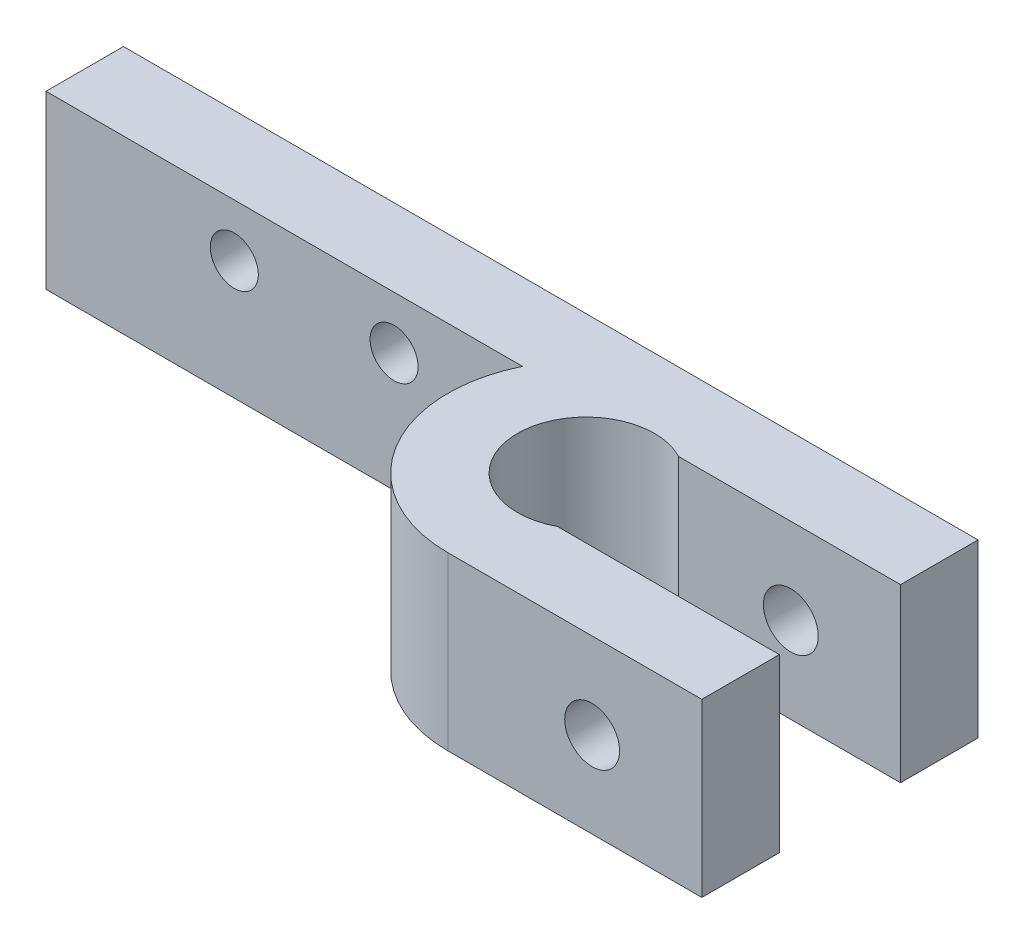
ISO-10303-21;
HEADER;
FILE_DESCRIPTION(('STEP AP214'),'2;1');
FILE_NAME('part.step','',(''),(''),'','','');
FILE_SCHEMA(('AUTOMOTIVE_DESIGN { 1 0 10303 214 1 1 1 1 }'));
ENDSEC;
DATA;
#1=APPLICATION_CONTEXT('core data for automotive mechanical design processes');
#2=APPLICATION_PROTOCOL_DEFINITION('international standard','automotive_design',2000,#1);
#3=PRODUCT_CONTEXT('',#1,'mechanical');
#4=PRODUCT('Part','Part','',(#3));
#5=PRODUCT_RELATED_PRODUCT_CATEGORY('part','',(#4));
#6=PRODUCT_DEFINITION_FORMATION('','',#4);
#7=PRODUCT_DEFINITION_CONTEXT('part definition',#1,'design');
#8=PRODUCT_DEFINITION('design','',#6,#7);
#9=PRODUCT_DEFINITION_SHAPE('','',#8);
#10=(LENGTH_UNIT() NAMED_UNIT(*) SI_UNIT(.MILLI.,.METRE.));
#11=(NAMED_UNIT(*) PLANE_ANGLE_UNIT() SI_UNIT($,.RADIAN.));
#12=(NAMED_UNIT(*) SI_UNIT($,.STERADIAN.) SOLID_ANGLE_UNIT());
#13=UNCERTAINTY_MEASURE_WITH_UNIT(LENGTH_MEASURE(1.E-05),#10,'distance_accuracy_value','');
#14=(GEOMETRIC_REPRESENTATION_CONTEXT(3) GLOBAL_UNCERTAINTY_ASSIGNED_CONTEXT((#13)) GLOBAL_UNIT_ASSIGNED_CONTEXT((#10,
#11,#12)) REPRESENTATION_CONTEXT('',''));
#15=CARTESIAN_POINT('',(0.,0.,0.));
#16=DIRECTION('',(0.,0.,1.));
#17=DIRECTION('',(1.,0.,0.));
#18=AXIS2_PLACEMENT_3D('',#15,#16,#17);
#19=CARTESIAN_POINT('',(-14.815,10.01,8.055));
#20=DIRECTION('',(0.,-1.,0.));
#21=DIRECTION('',(0.,0.,-1.));
#22=AXIS2_PLACEMENT_3D('',#19,#20,#21);
#23=CYLINDRICAL_SURFACE('',#22,8.055);
#24=CARTESIAN_POINT('',(-14.815,0.,8.055));
#25=DIRECTION('',(0.,1.,0.));
#26=DIRECTION('',(0.,0.,1.));
#27=AXIS2_PLACEMENT_3D('',#24,#25,#26);
#28=CIRCLE('',#27,8.055);
#29=CARTESIAN_POINT('',(-22.052872615624,0.,4.52));
#30=VERTEX_POINT('',#29);
#31=CARTESIAN_POINT('',(-14.815,0.,16.11));
#32=VERTEX_POINT('',#31);
#33=EDGE_CURVE('E139',#30,#32,#28,.T.);
#34=ORIENTED_EDGE('',*,*,#33,.T.);
#35=DIRECTION('',(0.,-1.,0.));
#36=VECTOR('',#35,1.);
#37=CARTESIAN_POINT('',(-14.815,10.01,16.11));
#38=LINE('',#37,#36);
#39=CARTESIAN_POINT('',(-14.815,10.01,16.11));
#40=VERTEX_POINT('',#39);
#41=EDGE_CURVE('E38',#40,#32,#38,.T.);
#42=ORIENTED_EDGE('',*,*,#41,.F.);
#43=CARTESIAN_POINT('',(-14.815,10.01,8.055));
#44=DIRECTION('',(0.,1.,0.));
#45=DIRECTION('',(0.,0.,1.));
#46=AXIS2_PLACEMENT_3D('',#43,#44,#45);
#47=CIRCLE('',#46,8.055);
#48=CARTESIAN_POINT('',(-22.052872615624,10.01,4.52));
#49=VERTEX_POINT('',#48);
#50=EDGE_CURVE('E157',#49,#40,#47,.T.);
#51=ORIENTED_EDGE('',*,*,#50,.F.);
#52=DIRECTION('',(0.,-1.,0.));
#53=VECTOR('',#52,1.);
#54=CARTESIAN_POINT('',(-22.052872615624,10.01,4.52));
#55=LINE('',#54,#53);
#56=EDGE_CURVE('E135',#49,#30,#55,.T.);
#57=ORIENTED_EDGE('',*,*,#56,.T.);
#58=EDGE_LOOP('',(#34,#42,#51,#57));
#59=FACE_BOUND('',#58,.T.);
#60=ADVANCED_FACE('F31',(#59),#23,.T.);
#61=CARTESIAN_POINT('',(-14.815,10.01,16.11));
#62=DIRECTION('',(0.,0.,-1.));
#63=DIRECTION('',(-1.,0.,0.));
#64=AXIS2_PLACEMENT_3D('',#61,#62,#63);
#65=PLANE('',#64);
#66=CARTESIAN_POINT('',(-6.39994887972684,5.005,16.11));
#67=DIRECTION('',(0.,0.,-1.));
#68=DIRECTION('',(-1.,0.,0.));
#69=AXIS2_PLACEMENT_3D('',#66,#67,#68);
#70=CIRCLE('',#69,1.6);
#71=CARTESIAN_POINT('',(-7.99994887972684,5.005,16.11));
#72=VERTEX_POINT('',#71);
#73=EDGE_CURVE('E209',#72,#72,#70,.T.);
#74=ORIENTED_EDGE('',*,*,#73,.T.);
#75=EDGE_LOOP('',(#74));
#76=FACE_BOUND('',#75,.T.);
#77=DIRECTION('',(1.,0.,0.));
#78=VECTOR('',#77,1.);
#79=CARTESIAN_POINT('',(-14.815,0.,16.11));
#80=LINE('',#79,#78);
#81=CARTESIAN_POINT('',(0.,0.,16.11));
#82=VERTEX_POINT('',#81);
#83=EDGE_CURVE('E142',#32,#82,#80,.T.);
#84=ORIENTED_EDGE('',*,*,#83,.T.);
#85=DIRECTION('',(0.,-1.,0.));
#86=VECTOR('',#85,1.);
#87=CARTESIAN_POINT('',(0.,10.01,16.11));
#88=LINE('',#87,#86);
#89=CARTESIAN_POINT('',(0.,10.01,16.11));
#90=VERTEX_POINT('',#89);
#91=EDGE_CURVE('E167',#90,#82,#88,.T.);
#92=ORIENTED_EDGE('',*,*,#91,.F.);
#93=DIRECTION('',(1.,0.,0.));
#94=VECTOR('',#93,1.);
#95=CARTESIAN_POINT('',(-14.815,10.01,16.11));
#96=LINE('',#95,#94);
#97=EDGE_CURVE('E95',#40,#90,#96,.T.);
#98=ORIENTED_EDGE('',*,*,#97,.F.);
#99=ORIENTED_EDGE('',*,*,#41,.T.);
#100=EDGE_LOOP('',(#84,#92,#98,#99));
#101=FACE_BOUND('',#100,.T.);
#102=ADVANCED_FACE('F170',(#76,#101),#65,.F.);
#103=CARTESIAN_POINT('',(0.,10.01,11.59));
#104=DIRECTION('',(-1.,0.,0.));
#105=DIRECTION('',(0.,0.,1.));
#106=AXIS2_PLACEMENT_3D('',#103,#104,#105);
#107=PLANE('',#106);
#108=DIRECTION('',(0.,0.,-1.));
#109=VECTOR('',#108,1.);
#110=CARTESIAN_POINT('',(0.,0.,11.59));
#111=LINE('',#110,#109);
#112=CARTESIAN_POINT('',(0.,0.,11.59));
#113=VERTEX_POINT('',#112);
#114=EDGE_CURVE('E144',#82,#113,#111,.T.);
#115=ORIENTED_EDGE('',*,*,#114,.T.);
#116=DIRECTION('',(0.,-1.,0.));
#117=VECTOR('',#116,1.);
#118=CARTESIAN_POINT('',(0.,10.01,11.59));
#119=LINE('',#118,#117);
#120=CARTESIAN_POINT('',(0.,10.01,11.59));
#121=VERTEX_POINT('',#120);
#122=EDGE_CURVE('E164',#121,#113,#119,.T.);
#123=ORIENTED_EDGE('',*,*,#122,.F.);
#124=DIRECTION('',(0.,0.,-1.));
#125=VECTOR('',#124,1.);
#126=CARTESIAN_POINT('',(0.,10.01,11.59));
#127=LINE('',#126,#125);
#128=EDGE_CURVE('E190',#90,#121,#127,.T.);
#129=ORIENTED_EDGE('',*,*,#128,.F.);
#130=ORIENTED_EDGE('',*,*,#91,.T.);
#131=EDGE_LOOP('',(#115,#123,#129,#130));
#132=FACE_BOUND('',#131,.T.);
#133=ADVANCED_FACE('F181',(#132),#107,.F.);
#134=CARTESIAN_POINT('',(-14.815,10.01,11.59));
#135=DIRECTION('',(0.,0.,1.));
#136=DIRECTION('',(1.,0.,0.));
#137=AXIS2_PLACEMENT_3D('',#134,#135,#136);
#138=PLANE('',#137);
#139=CARTESIAN_POINT('',(-6.39994887972684,5.005,11.59));
#140=DIRECTION('',(0.,0.,1.));
#141=DIRECTION('',(1.,0.,0.));
#142=AXIS2_PLACEMENT_3D('',#139,#140,#141);
#143=CIRCLE('',#142,1.6);
#144=CARTESIAN_POINT('',(-4.79994887972683,5.005,11.59));
#145=VERTEX_POINT('',#144);
#146=EDGE_CURVE('E203',#145,#145,#143,.T.);
#147=ORIENTED_EDGE('',*,*,#146,.T.);
#148=EDGE_LOOP('',(#147));
#149=FACE_BOUND('',#148,.T.);
#150=DIRECTION('',(-1.,0.,0.));
#151=VECTOR('',#150,1.);
#152=CARTESIAN_POINT('',(-14.815,0.,11.59));
#153=LINE('',#152,#151);
#154=CARTESIAN_POINT('',(-12.9431626673239,0.,11.59));
#155=VERTEX_POINT('',#154);
#156=EDGE_CURVE('E146',#113,#155,#153,.T.);
#157=ORIENTED_EDGE('',*,*,#156,.T.);
#158=DIRECTION('',(0.,1.,0.));
#159=VECTOR('',#158,1.);
#160=CARTESIAN_POINT('',(-12.9431626673239,0.,11.59));
#161=LINE('',#160,#159);
#162=CARTESIAN_POINT('',(-12.9431626673239,10.01,11.59));
#163=VERTEX_POINT('',#162);
#164=EDGE_CURVE('E45',#155,#163,#161,.T.);
#165=ORIENTED_EDGE('',*,*,#164,.T.);
#166=DIRECTION('',(-1.,0.,0.));
#167=VECTOR('',#166,1.);
#168=CARTESIAN_POINT('',(-14.815,10.01,11.59));
#169=LINE('',#168,#167);
#170=EDGE_CURVE('E187',#121,#163,#169,.T.);
#171=ORIENTED_EDGE('',*,*,#170,.F.);
#172=ORIENTED_EDGE('',*,*,#122,.T.);
#173=EDGE_LOOP('',(#157,#165,#171,#172));
#174=FACE_BOUND('',#173,.T.);
#175=ADVANCED_FACE('F185',(#149,#174),#138,.F.);
#176=CARTESIAN_POINT('',(0.,10.01,4.52));
#177=DIRECTION('',(0.,0.,-1.));
#178=DIRECTION('',(-1.,0.,0.));
#179=AXIS2_PLACEMENT_3D('',#176,#177,#178);
#180=PLANE('',#179);
#181=CARTESIAN_POINT('',(-6.39994887972684,5.005,4.52));
#182=DIRECTION('',(0.,0.,-1.));
#183=DIRECTION('',(-1.,0.,0.));
#184=AXIS2_PLACEMENT_3D('',#181,#182,#183);
#185=CIRCLE('',#184,1.6);
#186=CARTESIAN_POINT('',(-7.99994887972684,5.005,4.52));
#187=VERTEX_POINT('',#186);
#188=EDGE_CURVE('E206',#187,#187,#185,.T.);
#189=ORIENTED_EDGE('',*,*,#188,.T.);
#190=EDGE_LOOP('',(#189));
#191=FACE_BOUND('',#190,.T.);
#192=DIRECTION('',(1.,0.,0.));
#193=VECTOR('',#192,1.);
#194=CARTESIAN_POINT('',(0.,10.01,4.52));
#195=LINE('',#194,#193);
#196=CARTESIAN_POINT('',(-12.9431626673239,10.01,4.52));
#197=VERTEX_POINT('',#196);
#198=CARTESIAN_POINT('',(0.,10.01,4.52));
#199=VERTEX_POINT('',#198);
#200=EDGE_CURVE('E189',#197,#199,#195,.T.);
#201=ORIENTED_EDGE('',*,*,#200,.F.);
#202=DIRECTION('',(0.,1.,0.));
#203=VECTOR('',#202,1.);
#204=CARTESIAN_POINT('',(-12.9431626673239,0.,4.52));
#205=LINE('',#204,#203);
#206=CARTESIAN_POINT('',(-12.9431626673239,0.,4.52));
#207=VERTEX_POINT('',#206);
#208=EDGE_CURVE('E198',#197,#207,#205,.F.);
#209=ORIENTED_EDGE('',*,*,#208,.T.);
#210=DIRECTION('',(1.,0.,0.));
#211=VECTOR('',#210,1.);
#212=CARTESIAN_POINT('',(0.,0.,4.52));
#213=LINE('',#212,#211);
#214=CARTESIAN_POINT('',(0.,0.,4.52));
#215=VERTEX_POINT('',#214);
#216=EDGE_CURVE('E149',#207,#215,#213,.T.);
#217=ORIENTED_EDGE('',*,*,#216,.T.);
#218=DIRECTION('',(0.,-1.,0.));
#219=VECTOR('',#218,1.);
#220=CARTESIAN_POINT('',(0.,10.01,4.52));
#221=LINE('',#220,#219);
#222=EDGE_CURVE('E161',#199,#215,#221,.T.);
#223=ORIENTED_EDGE('',*,*,#222,.F.);
#224=EDGE_LOOP('',(#201,#209,#217,#223));
#225=FACE_BOUND('',#224,.T.);
#226=ADVANCED_FACE('F247',(#191,#225),#180,.F.);
#227=CARTESIAN_POINT('',(0.,10.01,0.));
#228=DIRECTION('',(-1.,0.,0.));
#229=DIRECTION('',(0.,0.,1.));
#230=AXIS2_PLACEMENT_3D('',#227,#228,#229);
#231=PLANE('',#230);
#232=DIRECTION('',(0.,0.,-1.));
#233=VECTOR('',#232,1.);
#234=CARTESIAN_POINT('',(0.,0.,0.));
#235=LINE('',#234,#233);
#236=CARTESIAN_POINT('',(0.,0.,0.));
#237=VERTEX_POINT('',#236);
#238=EDGE_CURVE('E151',#215,#237,#235,.T.);
#239=ORIENTED_EDGE('',*,*,#238,.T.);
#240=DIRECTION('',(0.,-1.,0.));
#241=VECTOR('',#240,1.);
#242=CARTESIAN_POINT('',(0.,10.01,0.));
#243=LINE('',#242,#241);
#244=CARTESIAN_POINT('',(0.,10.01,0.));
#245=VERTEX_POINT('',#244);
#246=EDGE_CURVE('E130',#245,#237,#243,.T.);
#247=ORIENTED_EDGE('',*,*,#246,.F.);
#248=DIRECTION('',(0.,0.,-1.));
#249=VECTOR('',#248,1.);
#250=CARTESIAN_POINT('',(0.,10.01,0.));
#251=LINE('',#250,#249);
#252=EDGE_CURVE('E118',#199,#245,#251,.T.);
#253=ORIENTED_EDGE('',*,*,#252,.F.);
#254=ORIENTED_EDGE('',*,*,#222,.T.);
#255=EDGE_LOOP('',(#239,#247,#253,#254));
#256=FACE_BOUND('',#255,.T.);
#257=ADVANCED_FACE('F233',(#256),#231,.F.);
#258=CARTESIAN_POINT('',(-49.85,10.01,0.));
#259=DIRECTION('',(0.,0.,1.));
#260=DIRECTION('',(1.,0.,0.));
#261=AXIS2_PLACEMENT_3D('',#258,#259,#260);
#262=PLANE('',#261);
#263=CARTESIAN_POINT('',(-38.865,6.94,0.));
#264=DIRECTION('',(0.,0.,-1.));
#265=DIRECTION('',(-1.,0.,0.));
#266=AXIS2_PLACEMENT_3D('',#263,#264,#265);
#267=CIRCLE('',#266,1.4);
#268=CARTESIAN_POINT('',(-40.265,6.94,0.));
#269=VERTEX_POINT('',#268);
#270=EDGE_CURVE('E224',#269,#269,#267,.T.);
#271=ORIENTED_EDGE('',*,*,#270,.F.);
#272=EDGE_LOOP('',(#271));
#273=FACE_BOUND('',#272,.T.);
#274=CARTESIAN_POINT('',(-29.545,6.94,0.));
#275=DIRECTION('',(0.,0.,-1.));
#276=DIRECTION('',(-1.,0.,0.));
#277=AXIS2_PLACEMENT_3D('',#274,#275,#276);
#278=CIRCLE('',#277,1.4);
#279=CARTESIAN_POINT('',(-30.945,6.94,0.));
#280=VERTEX_POINT('',#279);
#281=EDGE_CURVE('E218',#280,#280,#278,.T.);
#282=ORIENTED_EDGE('',*,*,#281,.F.);
#283=EDGE_LOOP('',(#282));
#284=FACE_BOUND('',#283,.T.);
#285=CARTESIAN_POINT('',(-6.39994887972684,5.005,0.));
#286=DIRECTION('',(0.,0.,-1.));
#287=DIRECTION('',(-1.,0.,0.));
#288=AXIS2_PLACEMENT_3D('',#285,#286,#287);
#289=CIRCLE('',#288,1.6);
#290=CARTESIAN_POINT('',(-7.99994887972684,5.005,0.));
#291=VERTEX_POINT('',#290);
#292=EDGE_CURVE('E210',#291,#291,#289,.T.);
#293=ORIENTED_EDGE('',*,*,#292,.F.);
#294=EDGE_LOOP('',(#293));
#295=FACE_BOUND('',#294,.T.);
#296=DIRECTION('',(-1.,0.,0.));
#297=VECTOR('',#296,1.);
#298=CARTESIAN_POINT('',(-49.85,0.,0.));
#299=LINE('',#298,#297);
#300=CARTESIAN_POINT('',(-49.85,0.,0.));
#301=VERTEX_POINT('',#300);
#302=EDGE_CURVE('E127',#237,#301,#299,.T.);
#303=ORIENTED_EDGE('',*,*,#302,.T.);
#304=DIRECTION('',(0.,-1.,0.));
#305=VECTOR('',#304,1.);
#306=CARTESIAN_POINT('',(-49.85,10.01,0.));
#307=LINE('',#306,#305);
#308=CARTESIAN_POINT('',(-49.85,10.01,0.));
#309=VERTEX_POINT('',#308);
#310=EDGE_CURVE('E124',#309,#301,#307,.T.);
#311=ORIENTED_EDGE('',*,*,#310,.F.);
#312=DIRECTION('',(-1.,0.,0.));
#313=VECTOR('',#312,1.);
#314=CARTESIAN_POINT('',(-49.85,10.01,0.));
#315=LINE('',#314,#313);
#316=EDGE_CURVE('E110',#245,#309,#315,.T.);
#317=ORIENTED_EDGE('',*,*,#316,.F.);
#318=ORIENTED_EDGE('',*,*,#246,.T.);
#319=EDGE_LOOP('',(#303,#311,#317,#318));
#320=FACE_BOUND('',#319,.T.);
#321=ADVANCED_FACE('F125',(#273,#284,#295,#320),#262,.F.);
#322=CARTESIAN_POINT('',(-49.85,10.01,4.52));
#323=DIRECTION('',(1.,0.,0.));
#324=DIRECTION('',(0.,0.,-1.));
#325=AXIS2_PLACEMENT_3D('',#322,#323,#324);
#326=PLANE('',#325);
#327=DIRECTION('',(0.,0.,1.));
#328=VECTOR('',#327,1.);
#329=CARTESIAN_POINT('',(-49.85,0.,4.52));
#330=LINE('',#329,#328);
#331=CARTESIAN_POINT('',(-49.85,0.,4.52));
#332=VERTEX_POINT('',#331);
#333=EDGE_CURVE('E154',#301,#332,#330,.T.);
#334=ORIENTED_EDGE('',*,*,#333,.T.);
#335=DIRECTION('',(0.,-1.,0.));
#336=VECTOR('',#335,1.);
#337=CARTESIAN_POINT('',(-49.85,10.01,4.52));
#338=LINE('',#337,#336);
#339=CARTESIAN_POINT('',(-49.85,10.01,4.52));
#340=VERTEX_POINT('',#339);
#341=EDGE_CURVE('E131',#340,#332,#338,.T.);
#342=ORIENTED_EDGE('',*,*,#341,.F.);
#343=DIRECTION('',(0.,0.,1.));
#344=VECTOR('',#343,1.);
#345=CARTESIAN_POINT('',(-49.85,10.01,4.52));
#346=LINE('',#345,#344);
#347=EDGE_CURVE('E115',#309,#340,#346,.T.);
#348=ORIENTED_EDGE('',*,*,#347,.F.);
#349=ORIENTED_EDGE('',*,*,#310,.T.);
#350=EDGE_LOOP('',(#334,#342,#348,#349));
#351=FACE_BOUND('',#350,.T.);
#352=ADVANCED_FACE('F133',(#351),#326,.F.);
#353=CARTESIAN_POINT('',(-22.052872615624,10.01,4.52));
#354=DIRECTION('',(0.,0.,-1.));
#355=DIRECTION('',(-1.,0.,0.));
#356=AXIS2_PLACEMENT_3D('',#353,#354,#355);
#357=PLANE('',#356);
#358=CARTESIAN_POINT('',(-38.865,6.94,4.52));
#359=DIRECTION('',(0.,0.,-1.));
#360=DIRECTION('',(-1.,0.,0.));
#361=AXIS2_PLACEMENT_3D('',#358,#359,#360);
#362=CIRCLE('',#361,1.4);
#363=CARTESIAN_POINT('',(-40.265,6.94,4.52));
#364=VERTEX_POINT('',#363);
#365=EDGE_CURVE('E221',#364,#364,#362,.F.);
#366=ORIENTED_EDGE('',*,*,#365,.F.);
#367=EDGE_LOOP('',(#366));
#368=FACE_BOUND('',#367,.T.);
#369=CARTESIAN_POINT('',(-29.545,6.94,4.52));
#370=DIRECTION('',(0.,0.,-1.));
#371=DIRECTION('',(-1.,0.,0.));
#372=AXIS2_PLACEMENT_3D('',#369,#370,#371);
#373=CIRCLE('',#372,1.4);
#374=CARTESIAN_POINT('',(-30.945,6.94,4.52));
#375=VERTEX_POINT('',#374);
#376=EDGE_CURVE('E213',#375,#375,#373,.F.);
#377=ORIENTED_EDGE('',*,*,#376,.F.);
#378=EDGE_LOOP('',(#377));
#379=FACE_BOUND('',#378,.T.);
#380=DIRECTION('',(1.,0.,0.));
#381=VECTOR('',#380,1.);
#382=CARTESIAN_POINT('',(-22.052872615624,0.,4.52));
#383=LINE('',#382,#381);
#384=EDGE_CURVE('E86',#332,#30,#383,.T.);
#385=ORIENTED_EDGE('',*,*,#384,.T.);
#386=ORIENTED_EDGE('',*,*,#56,.F.);
#387=DIRECTION('',(1.,0.,0.));
#388=VECTOR('',#387,1.);
#389=CARTESIAN_POINT('',(-22.052872615624,10.01,4.52));
#390=LINE('',#389,#388);
#391=EDGE_CURVE('E53',#340,#49,#390,.T.);
#392=ORIENTED_EDGE('',*,*,#391,.F.);
#393=ORIENTED_EDGE('',*,*,#341,.T.);
#394=EDGE_LOOP('',(#385,#386,#392,#393));
#395=FACE_BOUND('',#394,.T.);
#396=ADVANCED_FACE('F258',(#368,#379,#395),#357,.F.);
#397=CARTESIAN_POINT('',(-14.815,10.01,8.055));
#398=DIRECTION('',(0.,1.,0.));
#399=DIRECTION('',(0.,0.,1.));
#400=AXIS2_PLACEMENT_3D('',#397,#398,#399);
#401=PLANE('',#400);
#402=CARTESIAN_POINT('',(-14.815,10.01,8.055));
#403=DIRECTION('',(0.,1.,0.));
#404=DIRECTION('',(0.,0.,1.));
#405=AXIS2_PLACEMENT_3D('',#402,#403,#404);
#406=CIRCLE('',#405,4.);
#407=EDGE_CURVE('E201',#197,#163,#406,.T.);
#408=ORIENTED_EDGE('',*,*,#407,.F.);
#409=ORIENTED_EDGE('',*,*,#200,.T.);
#410=ORIENTED_EDGE('',*,*,#252,.T.);
#411=ORIENTED_EDGE('',*,*,#316,.T.);
#412=ORIENTED_EDGE('',*,*,#347,.T.);
#413=ORIENTED_EDGE('',*,*,#391,.T.);
#414=ORIENTED_EDGE('',*,*,#50,.T.);
#415=ORIENTED_EDGE('',*,*,#97,.T.);
#416=ORIENTED_EDGE('',*,*,#128,.T.);
#417=ORIENTED_EDGE('',*,*,#170,.T.);
#418=EDGE_LOOP('',(#408,#409,#410,#411,#412,#413,#414,#415,#416,#417));
#419=FACE_BOUND('',#418,.T.);
#420=ADVANCED_FACE('F113',(#419),#401,.T.);
#421=CARTESIAN_POINT('',(-14.815,0.,8.055));
#422=DIRECTION('',(0.,1.,0.));
#423=DIRECTION('',(0.,0.,1.));
#424=AXIS2_PLACEMENT_3D('',#421,#422,#423);
#425=PLANE('',#424);
#426=ORIENTED_EDGE('',*,*,#216,.F.);
#427=CARTESIAN_POINT('',(-14.815,0.,8.055));
#428=DIRECTION('',(0.,1.,0.));
#429=DIRECTION('',(0.,0.,1.));
#430=AXIS2_PLACEMENT_3D('',#427,#428,#429);
#431=CIRCLE('',#430,4.);
#432=EDGE_CURVE('E11',#207,#155,#431,.T.);
#433=ORIENTED_EDGE('',*,*,#432,.T.);
#434=ORIENTED_EDGE('',*,*,#156,.F.);
#435=ORIENTED_EDGE('',*,*,#114,.F.);
#436=ORIENTED_EDGE('',*,*,#83,.F.);
#437=ORIENTED_EDGE('',*,*,#33,.F.);
#438=ORIENTED_EDGE('',*,*,#384,.F.);
#439=ORIENTED_EDGE('',*,*,#333,.F.);
#440=ORIENTED_EDGE('',*,*,#302,.F.);
#441=ORIENTED_EDGE('',*,*,#238,.F.);
#442=EDGE_LOOP('',(#426,#433,#434,#435,#436,#437,#438,#439,#440,#441));
#443=FACE_BOUND('',#442,.T.);
#444=ADVANCED_FACE('F176',(#443),#425,.F.);
#445=CARTESIAN_POINT('',(-14.815,0.,8.055));
#446=DIRECTION('',(0.,1.,0.));
#447=DIRECTION('',(0.,0.,1.));
#448=AXIS2_PLACEMENT_3D('',#445,#446,#447);
#449=CYLINDRICAL_SURFACE('',#448,4.);
#450=ORIENTED_EDGE('',*,*,#432,.F.);
#451=ORIENTED_EDGE('',*,*,#208,.F.);
#452=ORIENTED_EDGE('',*,*,#407,.T.);
#453=ORIENTED_EDGE('',*,*,#164,.F.);
#454=EDGE_LOOP('',(#450,#451,#452,#453));
#455=FACE_BOUND('',#454,.T.);
#456=ADVANCED_FACE('F243',(#455),#449,.F.);
#457=CARTESIAN_POINT('',(-6.39994887972684,5.005,16.11));
#458=DIRECTION('',(0.,0.,-1.));
#459=DIRECTION('',(-1.,0.,0.));
#460=AXIS2_PLACEMENT_3D('',#457,#458,#459);
#461=CYLINDRICAL_SURFACE('',#460,1.6);
#462=ORIENTED_EDGE('',*,*,#292,.T.);
#463=EDGE_LOOP('',(#462));
#464=FACE_BOUND('',#463,.T.);
#465=ORIENTED_EDGE('',*,*,#188,.F.);
#466=EDGE_LOOP('',(#465));
#467=FACE_BOUND('',#466,.T.);
#468=ADVANCED_FACE('F239',(#464,#467),#461,.F.);
#469=ORIENTED_EDGE('',*,*,#73,.F.);
#470=EDGE_LOOP('',(#469));
#471=FACE_BOUND('',#470,.T.);
#472=ORIENTED_EDGE('',*,*,#146,.F.);
#473=EDGE_LOOP('',(#472));
#474=FACE_BOUND('',#473,.T.);
#475=ADVANCED_FACE('F242',(#471,#474),#461,.F.);
#476=CARTESIAN_POINT('',(-29.545,6.94,16.111));
#477=DIRECTION('',(0.,0.,-1.));
#478=DIRECTION('',(-1.,0.,0.));
#479=AXIS2_PLACEMENT_3D('',#476,#477,#478);
#480=CYLINDRICAL_SURFACE('',#479,1.4);
#481=ORIENTED_EDGE('',*,*,#281,.T.);
#482=EDGE_LOOP('',(#481));
#483=FACE_BOUND('',#482,.T.);
#484=ORIENTED_EDGE('',*,*,#376,.T.);
#485=EDGE_LOOP('',(#484));
#486=FACE_BOUND('',#485,.T.);
#487=ADVANCED_FACE('F350',(#483,#486),#480,.F.);
#488=CARTESIAN_POINT('',(-38.865,6.94,16.111));
#489=DIRECTION('',(0.,0.,-1.));
#490=DIRECTION('',(-1.,0.,0.));
#491=AXIS2_PLACEMENT_3D('',#488,#489,#490);
#492=CYLINDRICAL_SURFACE('',#491,1.4);
#493=ORIENTED_EDGE('',*,*,#270,.T.);
#494=EDGE_LOOP('',(#493));
#495=FACE_BOUND('',#494,.T.);
#496=ORIENTED_EDGE('',*,*,#365,.T.);
#497=EDGE_LOOP('',(#496));
#498=FACE_BOUND('',#497,.T.);
#499=ADVANCED_FACE('F228',(#495,#498),#492,.F.);
#500=CLOSED_SHELL('',(#60,#102,#133,#175,#226,#257,#321,#352,#396,#420,#444,#456,#468,#475,#487,#499));
#501=MANIFOLD_SOLID_BREP('B2',#500);
#502=ADVANCED_BREP_SHAPE_REPRESENTATION('',(#18,#501),#14);
#503=SHAPE_DEFINITION_REPRESENTATION(#9,#502);
ENDSEC;
END-ISO-10303-21;
